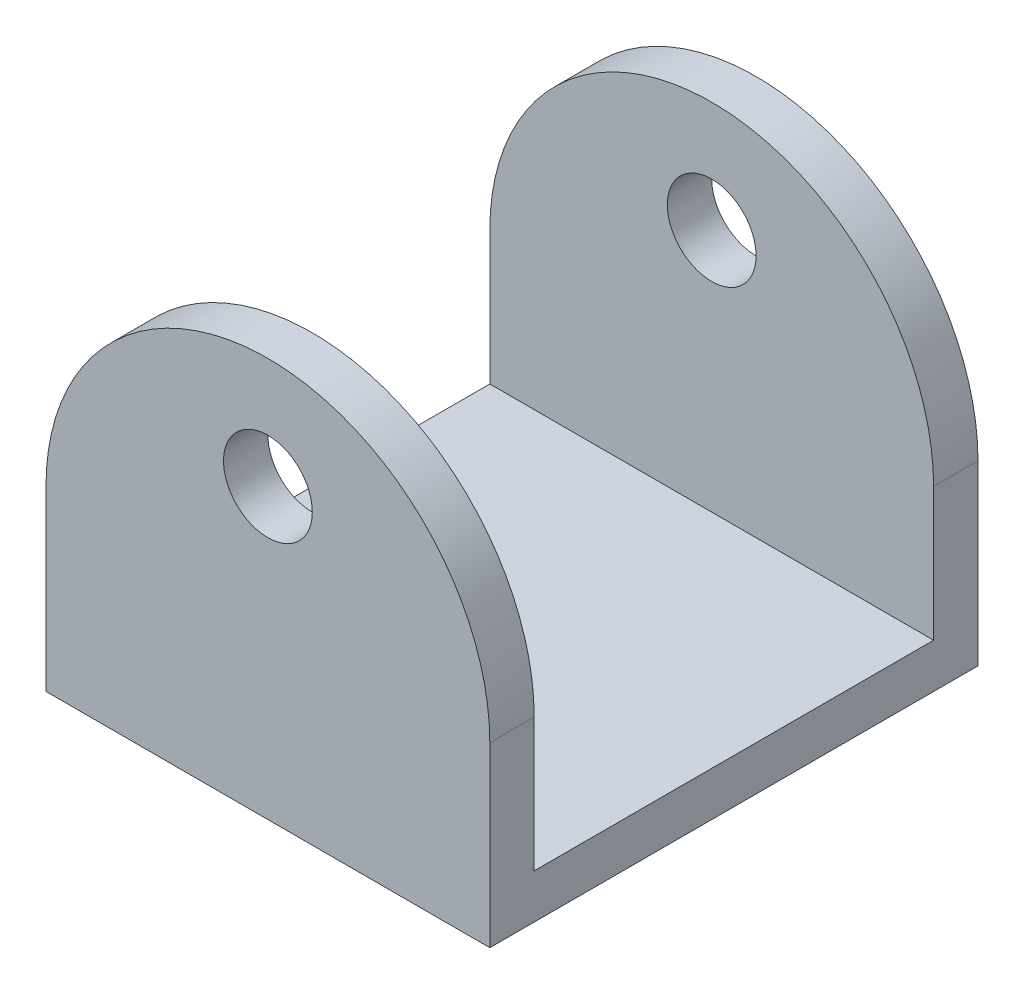
ISO-10303-21;
HEADER;
FILE_DESCRIPTION(('STEP AP214'),'2;1');
FILE_NAME('part.step','',(''),(''),'','','');
FILE_SCHEMA(('AUTOMOTIVE_DESIGN { 1 0 10303 214 1 1 1 1 }'));
ENDSEC;
DATA;
#1=APPLICATION_CONTEXT('core data for automotive mechanical design processes');
#2=APPLICATION_PROTOCOL_DEFINITION('international standard','automotive_design',2000,#1);
#3=PRODUCT_CONTEXT('',#1,'mechanical');
#4=PRODUCT('Part','Part','',(#3));
#5=PRODUCT_RELATED_PRODUCT_CATEGORY('part','',(#4));
#6=PRODUCT_DEFINITION_FORMATION('','',#4);
#7=PRODUCT_DEFINITION_CONTEXT('part definition',#1,'design');
#8=PRODUCT_DEFINITION('design','',#6,#7);
#9=PRODUCT_DEFINITION_SHAPE('','',#8);
#10=(LENGTH_UNIT() NAMED_UNIT(*) SI_UNIT(.MILLI.,.METRE.));
#11=(NAMED_UNIT(*) PLANE_ANGLE_UNIT() SI_UNIT($,.RADIAN.));
#12=(NAMED_UNIT(*) SI_UNIT($,.STERADIAN.) SOLID_ANGLE_UNIT());
#13=UNCERTAINTY_MEASURE_WITH_UNIT(LENGTH_MEASURE(1.E-05),#10,'distance_accuracy_value','');
#14=(GEOMETRIC_REPRESENTATION_CONTEXT(3) GLOBAL_UNCERTAINTY_ASSIGNED_CONTEXT((#13)) GLOBAL_UNIT_ASSIGNED_CONTEXT((#10,
#11,#12)) REPRESENTATION_CONTEXT('',''));
#15=CARTESIAN_POINT('',(0.,0.,0.));
#16=DIRECTION('',(0.,0.,1.));
#17=DIRECTION('',(1.,0.,0.));
#18=AXIS2_PLACEMENT_3D('',#15,#16,#17);
#19=CARTESIAN_POINT('',(9.03653846153848,-22.1028846153846,69.85));
#20=DIRECTION('',(0.,0.,-1.));
#21=DIRECTION('',(-1.,0.,0.));
#22=AXIS2_PLACEMENT_3D('',#19,#20,#21);
#23=CYLINDRICAL_SURFACE('',#22,31.75);
#24=DIRECTION('',(0.,0.,-1.));
#25=VECTOR('',#24,1.);
#26=CARTESIAN_POINT('',(-22.7134615384615,-22.1028846153846,69.85));
#27=LINE('',#26,#25);
#28=CARTESIAN_POINT('',(-22.7134615384615,-22.1028846153846,6.34999999999999));
#29=VERTEX_POINT('',#28);
#30=CARTESIAN_POINT('',(-22.7134615384615,-22.1028846153846,0.));
#31=VERTEX_POINT('',#30);
#32=EDGE_CURVE('E49',#29,#31,#27,.T.);
#33=ORIENTED_EDGE('',*,*,#32,.F.);
#34=CARTESIAN_POINT('',(9.03653846153848,-22.1028846153846,6.34999999999999));
#35=DIRECTION('',(0.,0.,-1.));
#36=DIRECTION('',(0.,1.,0.));
#37=AXIS2_PLACEMENT_3D('',#34,#35,#36);
#38=CIRCLE('',#37,31.75);
#39=CARTESIAN_POINT('',(40.7865384615385,-22.1028846153846,6.35));
#40=VERTEX_POINT('',#39);
#41=EDGE_CURVE('E154',#29,#40,#38,.T.);
#42=ORIENTED_EDGE('',*,*,#41,.T.);
#43=DIRECTION('',(0.,0.,-1.));
#44=VECTOR('',#43,1.);
#45=CARTESIAN_POINT('',(40.7865384615385,-22.1028846153846,69.85));
#46=LINE('',#45,#44);
#47=CARTESIAN_POINT('',(40.7865384615385,-22.1028846153846,0.));
#48=VERTEX_POINT('',#47);
#49=EDGE_CURVE('E88',#40,#48,#46,.T.);
#50=ORIENTED_EDGE('',*,*,#49,.T.);
#51=CARTESIAN_POINT('',(9.03653846153848,-22.1028846153846,0.));
#52=DIRECTION('',(0.,0.,1.));
#53=DIRECTION('',(-1.,0.,0.));
#54=AXIS2_PLACEMENT_3D('',#51,#52,#53);
#55=CIRCLE('',#54,31.75);
#56=EDGE_CURVE('E165',#48,#31,#55,.T.);
#57=ORIENTED_EDGE('',*,*,#56,.T.);
#58=EDGE_LOOP('',(#33,#42,#50,#57));
#59=FACE_BOUND('',#58,.T.);
#60=ADVANCED_FACE('F39',(#59),#23,.T.);
#61=CARTESIAN_POINT('',(9.03653846153848,-6.22788461538462,69.85));
#62=DIRECTION('',(0.,0.,-1.));
#63=DIRECTION('',(-1.,0.,0.));
#64=AXIS2_PLACEMENT_3D('',#61,#62,#63);
#65=CYLINDRICAL_SURFACE('',#64,6.35);
#66=CARTESIAN_POINT('',(9.03653846153848,-6.22788461538462,6.34999999999999));
#67=DIRECTION('',(0.,0.,-1.));
#68=DIRECTION('',(0.,1.,0.));
#69=AXIS2_PLACEMENT_3D('',#66,#67,#68);
#70=CIRCLE('',#69,6.35);
#71=CARTESIAN_POINT('',(9.03653846153848,0.122115384615379,6.34999999999999));
#72=VERTEX_POINT('',#71);
#73=EDGE_CURVE('E43',#72,#72,#70,.T.);
#74=ORIENTED_EDGE('',*,*,#73,.F.);
#75=EDGE_LOOP('',(#74));
#76=FACE_BOUND('',#75,.T.);
#77=CARTESIAN_POINT('',(9.03653846153848,-6.22788461538462,0.));
#78=DIRECTION('',(0.,0.,1.));
#79=DIRECTION('',(1.,0.,0.));
#80=AXIS2_PLACEMENT_3D('',#77,#78,#79);
#81=CIRCLE('',#80,6.35);
#82=CARTESIAN_POINT('',(15.3865384615385,-6.22788461538462,0.));
#83=VERTEX_POINT('',#82);
#84=EDGE_CURVE('E160',#83,#83,#81,.T.);
#85=ORIENTED_EDGE('',*,*,#84,.F.);
#86=EDGE_LOOP('',(#85));
#87=FACE_BOUND('',#86,.T.);
#88=ADVANCED_FACE('F211',(#76,#87),#65,.F.);
#89=CARTESIAN_POINT('',(9.03653846153848,-22.1028846153846,69.85));
#90=DIRECTION('',(0.,0.,-1.));
#91=DIRECTION('',(-1.,0.,0.));
#92=AXIS2_PLACEMENT_3D('',#89,#90,#91);
#93=PLANE('',#92);
#94=CARTESIAN_POINT('',(9.03653846153848,-22.1028846153846,69.85));
#95=DIRECTION('',(0.,0.,1.));
#96=DIRECTION('',(-1.,0.,0.));
#97=AXIS2_PLACEMENT_3D('',#94,#95,#96);
#98=CIRCLE('',#97,31.75);
#99=CARTESIAN_POINT('',(40.7865384615385,-22.1028846153846,69.85));
#100=VERTEX_POINT('',#99);
#101=CARTESIAN_POINT('',(-22.7134615384615,-22.1028846153846,69.85));
#102=VERTEX_POINT('',#101);
#103=EDGE_CURVE('E169',#100,#102,#98,.T.);
#104=ORIENTED_EDGE('',*,*,#103,.T.);
#105=DIRECTION('',(0.,-1.,0.));
#106=VECTOR('',#105,1.);
#107=CARTESIAN_POINT('',(-22.7134615384615,-22.1028846153846,69.85));
#108=LINE('',#107,#106);
#109=CARTESIAN_POINT('',(-22.7134615384615,-47.5028846153846,69.85));
#110=VERTEX_POINT('',#109);
#111=EDGE_CURVE('E95',#102,#110,#108,.T.);
#112=ORIENTED_EDGE('',*,*,#111,.T.);
#113=DIRECTION('',(1.,0.,0.));
#114=VECTOR('',#113,1.);
#115=CARTESIAN_POINT('',(-22.7134615384615,-47.5028846153846,69.85));
#116=LINE('',#115,#114);
#117=CARTESIAN_POINT('',(40.7865384615385,-47.5028846153846,69.85));
#118=VERTEX_POINT('',#117);
#119=EDGE_CURVE('E175',#110,#118,#116,.T.);
#120=ORIENTED_EDGE('',*,*,#119,.T.);
#121=DIRECTION('',(0.,1.,0.));
#122=VECTOR('',#121,1.);
#123=CARTESIAN_POINT('',(40.7865384615385,-22.1028846153846,69.85));
#124=LINE('',#123,#122);
#125=EDGE_CURVE('E66',#118,#100,#124,.T.);
#126=ORIENTED_EDGE('',*,*,#125,.T.);
#127=EDGE_LOOP('',(#104,#112,#120,#126));
#128=FACE_BOUND('',#127,.T.);
#129=CARTESIAN_POINT('',(9.03653846153848,-6.22788461538462,69.85));
#130=DIRECTION('',(0.,0.,1.));
#131=DIRECTION('',(1.,0.,0.));
#132=AXIS2_PLACEMENT_3D('',#129,#130,#131);
#133=CIRCLE('',#132,6.35);
#134=CARTESIAN_POINT('',(15.3865384615385,-6.22788461538462,69.85));
#135=VERTEX_POINT('',#134);
#136=EDGE_CURVE('E161',#135,#135,#133,.T.);
#137=ORIENTED_EDGE('',*,*,#136,.F.);
#138=EDGE_LOOP('',(#137));
#139=FACE_BOUND('',#138,.T.);
#140=ADVANCED_FACE('F214',(#128,#139),#93,.F.);
#141=CARTESIAN_POINT('',(9.03653846153848,-22.1028846153846,0.));
#142=DIRECTION('',(0.,0.,-1.));
#143=DIRECTION('',(-1.,0.,0.));
#144=AXIS2_PLACEMENT_3D('',#141,#142,#143);
#145=PLANE('',#144);
#146=ORIENTED_EDGE('',*,*,#56,.F.);
#147=DIRECTION('',(0.,1.,0.));
#148=VECTOR('',#147,1.);
#149=CARTESIAN_POINT('',(40.7865384615385,-22.1028846153846,0.));
#150=LINE('',#149,#148);
#151=CARTESIAN_POINT('',(40.7865384615385,-47.5028846153846,0.));
#152=VERTEX_POINT('',#151);
#153=EDGE_CURVE('E172',#152,#48,#150,.T.);
#154=ORIENTED_EDGE('',*,*,#153,.F.);
#155=DIRECTION('',(1.,0.,0.));
#156=VECTOR('',#155,1.);
#157=CARTESIAN_POINT('',(-22.7134615384615,-47.5028846153846,0.));
#158=LINE('',#157,#156);
#159=CARTESIAN_POINT('',(-22.7134615384615,-47.5028846153846,0.));
#160=VERTEX_POINT('',#159);
#161=EDGE_CURVE('E185',#160,#152,#158,.T.);
#162=ORIENTED_EDGE('',*,*,#161,.F.);
#163=DIRECTION('',(0.,-1.,0.));
#164=VECTOR('',#163,1.);
#165=CARTESIAN_POINT('',(-22.7134615384615,-22.1028846153846,0.));
#166=LINE('',#165,#164);
#167=EDGE_CURVE('E182',#31,#160,#166,.T.);
#168=ORIENTED_EDGE('',*,*,#167,.F.);
#169=EDGE_LOOP('',(#146,#154,#162,#168));
#170=FACE_BOUND('',#169,.T.);
#171=ORIENTED_EDGE('',*,*,#84,.T.);
#172=EDGE_LOOP('',(#171));
#173=FACE_BOUND('',#172,.T.);
#174=ADVANCED_FACE('F216',(#170,#173),#145,.T.);
#175=CARTESIAN_POINT('',(40.7865384615385,-22.1028846153846,63.5));
#176=VERTEX_POINT('',#175);
#177=EDGE_CURVE('E190',#100,#176,#46,.T.);
#178=ORIENTED_EDGE('',*,*,#177,.T.);
#179=CARTESIAN_POINT('',(9.03653846153848,-22.1028846153846,63.5));
#180=DIRECTION('',(0.,0.,1.));
#181=DIRECTION('',(1.,0.,0.));
#182=AXIS2_PLACEMENT_3D('',#179,#180,#181);
#183=CIRCLE('',#182,31.75);
#184=CARTESIAN_POINT('',(-22.7134615384615,-22.1028846153846,63.5));
#185=VERTEX_POINT('',#184);
#186=EDGE_CURVE('E148',#176,#185,#183,.T.);
#187=ORIENTED_EDGE('',*,*,#186,.T.);
#188=EDGE_CURVE('E11',#102,#185,#27,.T.);
#189=ORIENTED_EDGE('',*,*,#188,.F.);
#190=ORIENTED_EDGE('',*,*,#103,.F.);
#191=EDGE_LOOP('',(#178,#187,#189,#190));
#192=FACE_BOUND('',#191,.T.);
#193=ADVANCED_FACE('F41',(#192),#23,.T.);
#194=CARTESIAN_POINT('',(-22.7134615384615,-22.1028846153846,69.85));
#195=DIRECTION('',(1.,0.,0.));
#196=DIRECTION('',(0.,0.,-1.));
#197=AXIS2_PLACEMENT_3D('',#194,#195,#196);
#198=PLANE('',#197);
#199=DIRECTION('',(0.,0.,-1.));
#200=VECTOR('',#199,1.);
#201=CARTESIAN_POINT('',(-22.7134615384615,-41.1528846153846,69.85));
#202=LINE('',#201,#200);
#203=CARTESIAN_POINT('',(-22.7134615384615,-41.1528846153846,63.5));
#204=VERTEX_POINT('',#203);
#205=CARTESIAN_POINT('',(-22.7134615384615,-41.1528846153846,6.35000000000001));
#206=VERTEX_POINT('',#205);
#207=EDGE_CURVE('E157',#204,#206,#202,.T.);
#208=ORIENTED_EDGE('',*,*,#207,.T.);
#209=DIRECTION('',(0.,1.,0.));
#210=VECTOR('',#209,1.);
#211=CARTESIAN_POINT('',(-22.7134615384615,-22.1028846153846,6.34999999999999));
#212=LINE('',#211,#210);
#213=EDGE_CURVE('E123',#206,#29,#212,.T.);
#214=ORIENTED_EDGE('',*,*,#213,.T.);
#215=ORIENTED_EDGE('',*,*,#32,.T.);
#216=ORIENTED_EDGE('',*,*,#167,.T.);
#217=DIRECTION('',(0.,0.,-1.));
#218=VECTOR('',#217,1.);
#219=CARTESIAN_POINT('',(-22.7134615384615,-47.5028846153846,69.85));
#220=LINE('',#219,#218);
#221=EDGE_CURVE('E198',#110,#160,#220,.T.);
#222=ORIENTED_EDGE('',*,*,#221,.F.);
#223=ORIENTED_EDGE('',*,*,#111,.F.);
#224=ORIENTED_EDGE('',*,*,#188,.T.);
#225=DIRECTION('',(0.,-1.,0.));
#226=VECTOR('',#225,1.);
#227=CARTESIAN_POINT('',(-22.7134615384615,-22.1028846153846,63.5));
#228=LINE('',#227,#226);
#229=EDGE_CURVE('E144',#185,#204,#228,.T.);
#230=ORIENTED_EDGE('',*,*,#229,.T.);
#231=EDGE_LOOP('',(#208,#214,#215,#216,#222,#223,#224,#230));
#232=FACE_BOUND('',#231,.T.);
#233=ADVANCED_FACE('F230',(#232),#198,.F.);
#234=CARTESIAN_POINT('',(-22.7134615384615,-47.5028846153846,69.85));
#235=DIRECTION('',(0.,1.,0.));
#236=DIRECTION('',(0.,0.,1.));
#237=AXIS2_PLACEMENT_3D('',#234,#235,#236);
#238=PLANE('',#237);
#239=ORIENTED_EDGE('',*,*,#161,.T.);
#240=DIRECTION('',(0.,0.,-1.));
#241=VECTOR('',#240,1.);
#242=CARTESIAN_POINT('',(40.7865384615385,-47.5028846153846,69.85));
#243=LINE('',#242,#241);
#244=EDGE_CURVE('E194',#118,#152,#243,.T.);
#245=ORIENTED_EDGE('',*,*,#244,.F.);
#246=ORIENTED_EDGE('',*,*,#119,.F.);
#247=ORIENTED_EDGE('',*,*,#221,.T.);
#248=EDGE_LOOP('',(#239,#245,#246,#247));
#249=FACE_BOUND('',#248,.T.);
#250=ADVANCED_FACE('F235',(#249),#238,.F.);
#251=CARTESIAN_POINT('',(40.7865384615385,-22.1028846153846,69.85));
#252=DIRECTION('',(-1.,0.,0.));
#253=DIRECTION('',(0.,-1.,0.));
#254=AXIS2_PLACEMENT_3D('',#251,#252,#253);
#255=PLANE('',#254);
#256=ORIENTED_EDGE('',*,*,#49,.F.);
#257=DIRECTION('',(0.,-1.,0.));
#258=VECTOR('',#257,1.);
#259=CARTESIAN_POINT('',(40.7865384615385,13.3691392344426,6.35));
#260=LINE('',#259,#258);
#261=CARTESIAN_POINT('',(40.7865384615385,-41.1528846153846,6.35000000000001));
#262=VERTEX_POINT('',#261);
#263=EDGE_CURVE('E121',#40,#262,#260,.T.);
#264=ORIENTED_EDGE('',*,*,#263,.T.);
#265=DIRECTION('',(0.,0.,1.));
#266=VECTOR('',#265,1.);
#267=CARTESIAN_POINT('',(40.7865384615385,-41.1528846153846,6.35000000000001));
#268=LINE('',#267,#266);
#269=CARTESIAN_POINT('',(40.7865384615385,-41.1528846153846,63.5));
#270=VERTEX_POINT('',#269);
#271=EDGE_CURVE('E130',#262,#270,#268,.T.);
#272=ORIENTED_EDGE('',*,*,#271,.T.);
#273=DIRECTION('',(0.,1.,0.));
#274=VECTOR('',#273,1.);
#275=CARTESIAN_POINT('',(40.7865384615385,13.3691392344426,63.5));
#276=LINE('',#275,#274);
#277=EDGE_CURVE('E57',#270,#176,#276,.T.);
#278=ORIENTED_EDGE('',*,*,#277,.T.);
#279=ORIENTED_EDGE('',*,*,#177,.F.);
#280=ORIENTED_EDGE('',*,*,#125,.F.);
#281=ORIENTED_EDGE('',*,*,#244,.T.);
#282=ORIENTED_EDGE('',*,*,#153,.T.);
#283=EDGE_LOOP('',(#256,#264,#272,#278,#279,#280,#281,#282));
#284=FACE_BOUND('',#283,.T.);
#285=ADVANCED_FACE('F135',(#284),#255,.F.);
#286=CARTESIAN_POINT('',(9.03653846153848,-6.22788461538462,63.5));
#287=DIRECTION('',(0.,0.,1.));
#288=DIRECTION('',(1.,0.,0.));
#289=AXIS2_PLACEMENT_3D('',#286,#287,#288);
#290=CIRCLE('',#289,6.35);
#291=CARTESIAN_POINT('',(15.3865384615385,-6.22788461538462,63.5));
#292=VERTEX_POINT('',#291);
#293=EDGE_CURVE('E142',#292,#292,#290,.T.);
#294=ORIENTED_EDGE('',*,*,#293,.F.);
#295=EDGE_LOOP('',(#294));
#296=FACE_BOUND('',#295,.T.);
#297=ORIENTED_EDGE('',*,*,#136,.T.);
#298=EDGE_LOOP('',(#297));
#299=FACE_BOUND('',#298,.T.);
#300=ADVANCED_FACE('F207',(#296,#299),#65,.F.);
#301=CARTESIAN_POINT('',(40.7865384615385,-41.1528846153846,6.35000000000001));
#302=DIRECTION('',(0.,-1.,0.));
#303=DIRECTION('',(0.,0.,-1.));
#304=AXIS2_PLACEMENT_3D('',#301,#302,#303);
#305=PLANE('',#304);
#306=DIRECTION('',(-1.,0.,0.));
#307=VECTOR('',#306,1.);
#308=CARTESIAN_POINT('',(40.7865384615385,-41.1528846153846,63.5));
#309=LINE('',#308,#307);
#310=EDGE_CURVE('E127',#270,#204,#309,.T.);
#311=ORIENTED_EDGE('',*,*,#310,.F.);
#312=ORIENTED_EDGE('',*,*,#271,.F.);
#313=DIRECTION('',(-1.,0.,0.));
#314=VECTOR('',#313,1.);
#315=CARTESIAN_POINT('',(40.7865384615385,-41.1528846153846,6.35000000000001));
#316=LINE('',#315,#314);
#317=EDGE_CURVE('E117',#262,#206,#316,.T.);
#318=ORIENTED_EDGE('',*,*,#317,.T.);
#319=ORIENTED_EDGE('',*,*,#207,.F.);
#320=EDGE_LOOP('',(#311,#312,#318,#319));
#321=FACE_BOUND('',#320,.T.);
#322=ADVANCED_FACE('F131',(#321),#305,.F.);
#323=CARTESIAN_POINT('',(40.7865384615385,13.3691392344426,6.35));
#324=DIRECTION('',(0.,0.,-1.));
#325=DIRECTION('',(0.,1.,0.));
#326=AXIS2_PLACEMENT_3D('',#323,#324,#325);
#327=PLANE('',#326);
#328=ORIENTED_EDGE('',*,*,#73,.T.);
#329=EDGE_LOOP('',(#328));
#330=FACE_BOUND('',#329,.T.);
#331=ORIENTED_EDGE('',*,*,#213,.F.);
#332=ORIENTED_EDGE('',*,*,#317,.F.);
#333=ORIENTED_EDGE('',*,*,#263,.F.);
#334=ORIENTED_EDGE('',*,*,#41,.F.);
#335=EDGE_LOOP('',(#331,#332,#333,#334));
#336=FACE_BOUND('',#335,.T.);
#337=ADVANCED_FACE('F119',(#330,#336),#327,.F.);
#338=CARTESIAN_POINT('',(40.7865384615385,13.3691392344426,63.5));
#339=DIRECTION('',(0.,0.,1.));
#340=DIRECTION('',(1.,0.,0.));
#341=AXIS2_PLACEMENT_3D('',#338,#339,#340);
#342=PLANE('',#341);
#343=ORIENTED_EDGE('',*,*,#293,.T.);
#344=EDGE_LOOP('',(#343));
#345=FACE_BOUND('',#344,.T.);
#346=ORIENTED_EDGE('',*,*,#277,.F.);
#347=ORIENTED_EDGE('',*,*,#310,.T.);
#348=ORIENTED_EDGE('',*,*,#229,.F.);
#349=ORIENTED_EDGE('',*,*,#186,.F.);
#350=EDGE_LOOP('',(#346,#347,#348,#349));
#351=FACE_BOUND('',#350,.T.);
#352=ADVANCED_FACE('F205',(#345,#351),#342,.F.);
#353=CLOSED_SHELL('',(#60,#88,#140,#174,#193,#233,#250,#285,#300,#322,#337,#352));
#354=MANIFOLD_SOLID_BREP('B2',#353);
#355=ADVANCED_BREP_SHAPE_REPRESENTATION('',(#18,#354),#14);
#356=SHAPE_DEFINITION_REPRESENTATION(#9,#355);
ENDSEC;
END-ISO-10303-21;
